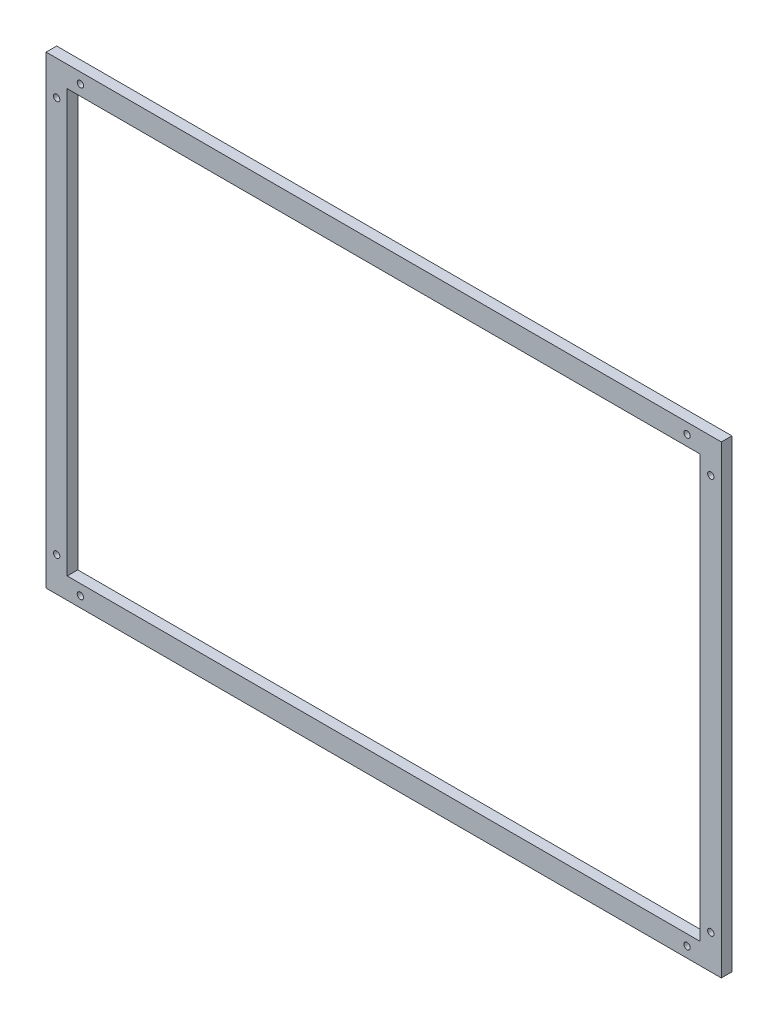
ISO-10303-21;
HEADER;
FILE_DESCRIPTION(('STEP AP214'),'2;1');
FILE_NAME('part.step','',(''),(''),'','','');
FILE_SCHEMA(('AUTOMOTIVE_DESIGN { 1 0 10303 214 1 1 1 1 }'));
ENDSEC;
DATA;
#1=APPLICATION_CONTEXT('core data for automotive mechanical design processes');
#2=APPLICATION_PROTOCOL_DEFINITION('international standard','automotive_design',2000,#1);
#3=PRODUCT_CONTEXT('',#1,'mechanical');
#4=PRODUCT('Part','Part','',(#3));
#5=PRODUCT_RELATED_PRODUCT_CATEGORY('part','',(#4));
#6=PRODUCT_DEFINITION_FORMATION('','',#4);
#7=PRODUCT_DEFINITION_CONTEXT('part definition',#1,'design');
#8=PRODUCT_DEFINITION('design','',#6,#7);
#9=PRODUCT_DEFINITION_SHAPE('','',#8);
#10=(LENGTH_UNIT() NAMED_UNIT(*) SI_UNIT(.MILLI.,.METRE.));
#11=(NAMED_UNIT(*) PLANE_ANGLE_UNIT() SI_UNIT($,.RADIAN.));
#12=(NAMED_UNIT(*) SI_UNIT($,.STERADIAN.) SOLID_ANGLE_UNIT());
#13=UNCERTAINTY_MEASURE_WITH_UNIT(LENGTH_MEASURE(1.E-05),#10,'distance_accuracy_value','');
#14=(GEOMETRIC_REPRESENTATION_CONTEXT(3) GLOBAL_UNCERTAINTY_ASSIGNED_CONTEXT((#13)) GLOBAL_UNIT_ASSIGNED_CONTEXT((#10,
#11,#12)) REPRESENTATION_CONTEXT('',''));
#15=CARTESIAN_POINT('',(0.,0.,0.));
#16=DIRECTION('',(0.,0.,1.));
#17=DIRECTION('',(1.,0.,0.));
#18=AXIS2_PLACEMENT_3D('',#15,#16,#17);
#19=CARTESIAN_POINT('',(0.,0.,10.));
#20=DIRECTION('',(0.,0.,1.));
#21=DIRECTION('',(1.,0.,0.));
#22=AXIS2_PLACEMENT_3D('',#19,#20,#21);
#23=PLANE('',#22);
#24=CARTESIAN_POINT('',(-10.,32.5,10.));
#25=DIRECTION('',(0.,0.,1.));
#26=DIRECTION('',(1.,0.,0.));
#27=AXIS2_PLACEMENT_3D('',#24,#25,#26);
#28=CIRCLE('',#27,3.);
#29=CARTESIAN_POINT('',(-7.,32.5,10.));
#30=VERTEX_POINT('',#29);
#31=EDGE_CURVE('E254',#30,#30,#28,.T.);
#32=ORIENTED_EDGE('',*,*,#31,.F.);
#33=EDGE_LOOP('',(#32));
#34=FACE_BOUND('',#33,.T.);
#35=CARTESIAN_POINT('',(-32.5,9.99999999999992,10.));
#36=DIRECTION('',(0.,0.,1.));
#37=DIRECTION('',(1.,0.,0.));
#38=AXIS2_PLACEMENT_3D('',#35,#36,#37);
#39=CIRCLE('',#38,3.);
#40=CARTESIAN_POINT('',(-29.5,9.99999999999992,10.));
#41=VERTEX_POINT('',#40);
#42=EDGE_CURVE('E256',#41,#41,#39,.T.);
#43=ORIENTED_EDGE('',*,*,#42,.F.);
#44=EDGE_LOOP('',(#43));
#45=FACE_BOUND('',#44,.T.);
#46=CARTESIAN_POINT('',(-607.5,9.99999999999995,10.));
#47=DIRECTION('',(0.,0.,1.));
#48=DIRECTION('',(1.,0.,0.));
#49=AXIS2_PLACEMENT_3D('',#46,#47,#48);
#50=CIRCLE('',#49,3.00000000000005);
#51=CARTESIAN_POINT('',(-604.5,9.99999999999995,10.));
#52=VERTEX_POINT('',#51);
#53=EDGE_CURVE('E262',#52,#52,#50,.T.);
#54=ORIENTED_EDGE('',*,*,#53,.F.);
#55=EDGE_LOOP('',(#54));
#56=FACE_BOUND('',#55,.T.);
#57=CARTESIAN_POINT('',(-630.,32.4999999999999,10.));
#58=DIRECTION('',(0.,0.,1.));
#59=DIRECTION('',(1.,0.,0.));
#60=AXIS2_PLACEMENT_3D('',#57,#58,#59);
#61=CIRCLE('',#60,3.00000000000005);
#62=CARTESIAN_POINT('',(-627.,32.4999999999999,10.));
#63=VERTEX_POINT('',#62);
#64=EDGE_CURVE('E268',#63,#63,#61,.T.);
#65=ORIENTED_EDGE('',*,*,#64,.F.);
#66=EDGE_LOOP('',(#65));
#67=FACE_BOUND('',#66,.T.);
#68=CARTESIAN_POINT('',(-630.,407.5,10.));
#69=DIRECTION('',(0.,0.,1.));
#70=DIRECTION('',(1.,0.,0.));
#71=AXIS2_PLACEMENT_3D('',#68,#69,#70);
#72=CIRCLE('',#71,3.00000000000005);
#73=CARTESIAN_POINT('',(-627.,407.5,10.));
#74=VERTEX_POINT('',#73);
#75=EDGE_CURVE('E274',#74,#74,#72,.T.);
#76=ORIENTED_EDGE('',*,*,#75,.F.);
#77=EDGE_LOOP('',(#76));
#78=FACE_BOUND('',#77,.T.);
#79=CARTESIAN_POINT('',(-607.5,430.,10.));
#80=DIRECTION('',(0.,0.,1.));
#81=DIRECTION('',(1.,0.,0.));
#82=AXIS2_PLACEMENT_3D('',#79,#80,#81);
#83=CIRCLE('',#82,3.00000000000005);
#84=CARTESIAN_POINT('',(-604.5,430.,10.));
#85=VERTEX_POINT('',#84);
#86=EDGE_CURVE('E280',#85,#85,#83,.T.);
#87=ORIENTED_EDGE('',*,*,#86,.F.);
#88=EDGE_LOOP('',(#87));
#89=FACE_BOUND('',#88,.T.);
#90=CARTESIAN_POINT('',(-10.,407.5,10.));
#91=DIRECTION('',(0.,0.,1.));
#92=DIRECTION('',(1.,0.,0.));
#93=AXIS2_PLACEMENT_3D('',#90,#91,#92);
#94=CIRCLE('',#93,3.);
#95=CARTESIAN_POINT('',(-7.,407.5,10.));
#96=VERTEX_POINT('',#95);
#97=EDGE_CURVE('E286',#96,#96,#94,.T.);
#98=ORIENTED_EDGE('',*,*,#97,.F.);
#99=EDGE_LOOP('',(#98));
#100=FACE_BOUND('',#99,.T.);
#101=CARTESIAN_POINT('',(-32.5,430.,10.));
#102=DIRECTION('',(0.,0.,1.));
#103=DIRECTION('',(1.,0.,0.));
#104=AXIS2_PLACEMENT_3D('',#101,#102,#103);
#105=CIRCLE('',#104,3.);
#106=CARTESIAN_POINT('',(-29.5,430.,10.));
#107=VERTEX_POINT('',#106);
#108=EDGE_CURVE('E292',#107,#107,#105,.T.);
#109=ORIENTED_EDGE('',*,*,#108,.F.);
#110=EDGE_LOOP('',(#109));
#111=FACE_BOUND('',#110,.T.);
#112=DIRECTION('',(0.,1.,0.));
#113=VECTOR('',#112,1.);
#114=CARTESIAN_POINT('',(0.,0.,10.));
#115=LINE('',#114,#113);
#116=CARTESIAN_POINT('',(0.,0.,10.));
#117=VERTEX_POINT('',#116);
#118=CARTESIAN_POINT('',(0.,440.,10.));
#119=VERTEX_POINT('',#118);
#120=EDGE_CURVE('E136',#117,#119,#115,.T.);
#121=ORIENTED_EDGE('',*,*,#120,.T.);
#122=DIRECTION('',(-1.,0.,0.));
#123=VECTOR('',#122,1.);
#124=CARTESIAN_POINT('',(0.,440.,10.));
#125=LINE('',#124,#123);
#126=CARTESIAN_POINT('',(-640.,440.,10.));
#127=VERTEX_POINT('',#126);
#128=EDGE_CURVE('E139',#119,#127,#125,.T.);
#129=ORIENTED_EDGE('',*,*,#128,.T.);
#130=DIRECTION('',(0.,-1.,0.));
#131=VECTOR('',#130,1.);
#132=CARTESIAN_POINT('',(-640.,0.,10.));
#133=LINE('',#132,#131);
#134=CARTESIAN_POINT('',(-640.,0.,10.));
#135=VERTEX_POINT('',#134);
#136=EDGE_CURVE('E142',#127,#135,#133,.T.);
#137=ORIENTED_EDGE('',*,*,#136,.T.);
#138=DIRECTION('',(1.,0.,0.));
#139=VECTOR('',#138,1.);
#140=CARTESIAN_POINT('',(0.,0.,10.));
#141=LINE('',#140,#139);
#142=EDGE_CURVE('E144',#135,#117,#141,.T.);
#143=ORIENTED_EDGE('',*,*,#142,.T.);
#144=EDGE_LOOP('',(#121,#129,#137,#143));
#145=FACE_BOUND('',#144,.T.);
#146=DIRECTION('',(1.,0.,0.));
#147=VECTOR('',#146,1.);
#148=CARTESIAN_POINT('',(-620.,19.9999999999999,10.));
#149=LINE('',#148,#147);
#150=CARTESIAN_POINT('',(-620.,19.9999999999999,10.));
#151=VERTEX_POINT('',#150);
#152=CARTESIAN_POINT('',(-20.,19.9999999999999,10.));
#153=VERTEX_POINT('',#152);
#154=EDGE_CURVE('E106',#151,#153,#149,.T.);
#155=ORIENTED_EDGE('',*,*,#154,.F.);
#156=DIRECTION('',(0.,-1.,0.));
#157=VECTOR('',#156,1.);
#158=CARTESIAN_POINT('',(-620.,420.,10.));
#159=LINE('',#158,#157);
#160=CARTESIAN_POINT('',(-620.,420.,10.));
#161=VERTEX_POINT('',#160);
#162=EDGE_CURVE('E98',#161,#151,#159,.T.);
#163=ORIENTED_EDGE('',*,*,#162,.F.);
#164=DIRECTION('',(-1.,0.,0.));
#165=VECTOR('',#164,1.);
#166=CARTESIAN_POINT('',(-620.,420.,10.));
#167=LINE('',#166,#165);
#168=CARTESIAN_POINT('',(-20.,420.,10.));
#169=VERTEX_POINT('',#168);
#170=EDGE_CURVE('E120',#169,#161,#167,.T.);
#171=ORIENTED_EDGE('',*,*,#170,.F.);
#172=DIRECTION('',(0.,1.,0.));
#173=VECTOR('',#172,1.);
#174=CARTESIAN_POINT('',(-20.,420.,10.));
#175=LINE('',#174,#173);
#176=EDGE_CURVE('E118',#153,#169,#175,.T.);
#177=ORIENTED_EDGE('',*,*,#176,.F.);
#178=EDGE_LOOP('',(#155,#163,#171,#177));
#179=FACE_BOUND('',#178,.T.);
#180=ADVANCED_FACE('F33',(#34,#45,#56,#67,#78,#89,#100,#111,#145,#179),#23,.T.);
#181=CARTESIAN_POINT('',(0.,0.,0.));
#182=DIRECTION('',(0.,0.,1.));
#183=DIRECTION('',(1.,0.,0.));
#184=AXIS2_PLACEMENT_3D('',#181,#182,#183);
#185=PLANE('',#184);
#186=CARTESIAN_POINT('',(-10.,32.5,0.));
#187=DIRECTION('',(0.,0.,1.));
#188=DIRECTION('',(1.,0.,0.));
#189=AXIS2_PLACEMENT_3D('',#186,#187,#188);
#190=CIRCLE('',#189,3.);
#191=CARTESIAN_POINT('',(-7.,32.5,0.));
#192=VERTEX_POINT('',#191);
#193=EDGE_CURVE('E252',#192,#192,#190,.T.);
#194=ORIENTED_EDGE('',*,*,#193,.T.);
#195=EDGE_LOOP('',(#194));
#196=FACE_BOUND('',#195,.T.);
#197=CARTESIAN_POINT('',(-32.5,9.99999999999992,0.));
#198=DIRECTION('',(0.,0.,1.));
#199=DIRECTION('',(1.,0.,0.));
#200=AXIS2_PLACEMENT_3D('',#197,#198,#199);
#201=CIRCLE('',#200,3.);
#202=CARTESIAN_POINT('',(-29.5,9.99999999999992,0.));
#203=VERTEX_POINT('',#202);
#204=EDGE_CURVE('E259',#203,#203,#201,.T.);
#205=ORIENTED_EDGE('',*,*,#204,.T.);
#206=EDGE_LOOP('',(#205));
#207=FACE_BOUND('',#206,.T.);
#208=CARTESIAN_POINT('',(-607.5,9.99999999999995,0.));
#209=DIRECTION('',(0.,0.,1.));
#210=DIRECTION('',(1.,0.,0.));
#211=AXIS2_PLACEMENT_3D('',#208,#209,#210);
#212=CIRCLE('',#211,3.00000000000005);
#213=CARTESIAN_POINT('',(-604.5,9.99999999999995,0.));
#214=VERTEX_POINT('',#213);
#215=EDGE_CURVE('E265',#214,#214,#212,.T.);
#216=ORIENTED_EDGE('',*,*,#215,.T.);
#217=EDGE_LOOP('',(#216));
#218=FACE_BOUND('',#217,.T.);
#219=CARTESIAN_POINT('',(-630.,32.4999999999999,0.));
#220=DIRECTION('',(0.,0.,1.));
#221=DIRECTION('',(1.,0.,0.));
#222=AXIS2_PLACEMENT_3D('',#219,#220,#221);
#223=CIRCLE('',#222,3.00000000000005);
#224=CARTESIAN_POINT('',(-627.,32.4999999999999,0.));
#225=VERTEX_POINT('',#224);
#226=EDGE_CURVE('E271',#225,#225,#223,.T.);
#227=ORIENTED_EDGE('',*,*,#226,.T.);
#228=EDGE_LOOP('',(#227));
#229=FACE_BOUND('',#228,.T.);
#230=CARTESIAN_POINT('',(-630.,407.5,0.));
#231=DIRECTION('',(0.,0.,1.));
#232=DIRECTION('',(1.,0.,0.));
#233=AXIS2_PLACEMENT_3D('',#230,#231,#232);
#234=CIRCLE('',#233,3.00000000000005);
#235=CARTESIAN_POINT('',(-627.,407.5,0.));
#236=VERTEX_POINT('',#235);
#237=EDGE_CURVE('E277',#236,#236,#234,.T.);
#238=ORIENTED_EDGE('',*,*,#237,.T.);
#239=EDGE_LOOP('',(#238));
#240=FACE_BOUND('',#239,.T.);
#241=CARTESIAN_POINT('',(-607.5,430.,0.));
#242=DIRECTION('',(0.,0.,1.));
#243=DIRECTION('',(1.,0.,0.));
#244=AXIS2_PLACEMENT_3D('',#241,#242,#243);
#245=CIRCLE('',#244,3.00000000000005);
#246=CARTESIAN_POINT('',(-604.5,430.,0.));
#247=VERTEX_POINT('',#246);
#248=EDGE_CURVE('E283',#247,#247,#245,.T.);
#249=ORIENTED_EDGE('',*,*,#248,.T.);
#250=EDGE_LOOP('',(#249));
#251=FACE_BOUND('',#250,.T.);
#252=CARTESIAN_POINT('',(-10.,407.5,0.));
#253=DIRECTION('',(0.,0.,1.));
#254=DIRECTION('',(1.,0.,0.));
#255=AXIS2_PLACEMENT_3D('',#252,#253,#254);
#256=CIRCLE('',#255,3.);
#257=CARTESIAN_POINT('',(-7.,407.5,0.));
#258=VERTEX_POINT('',#257);
#259=EDGE_CURVE('E289',#258,#258,#256,.T.);
#260=ORIENTED_EDGE('',*,*,#259,.T.);
#261=EDGE_LOOP('',(#260));
#262=FACE_BOUND('',#261,.T.);
#263=CARTESIAN_POINT('',(-32.5,430.,0.));
#264=DIRECTION('',(0.,0.,1.));
#265=DIRECTION('',(1.,0.,0.));
#266=AXIS2_PLACEMENT_3D('',#263,#264,#265);
#267=CIRCLE('',#266,3.);
#268=CARTESIAN_POINT('',(-29.5,430.,0.));
#269=VERTEX_POINT('',#268);
#270=EDGE_CURVE('E126',#269,#269,#267,.T.);
#271=ORIENTED_EDGE('',*,*,#270,.T.);
#272=EDGE_LOOP('',(#271));
#273=FACE_BOUND('',#272,.T.);
#274=DIRECTION('',(0.,1.,0.));
#275=VECTOR('',#274,1.);
#276=CARTESIAN_POINT('',(0.,0.,0.));
#277=LINE('',#276,#275);
#278=CARTESIAN_POINT('',(0.,0.,0.));
#279=VERTEX_POINT('',#278);
#280=CARTESIAN_POINT('',(0.,440.,0.));
#281=VERTEX_POINT('',#280);
#282=EDGE_CURVE('E114',#279,#281,#277,.T.);
#283=ORIENTED_EDGE('',*,*,#282,.F.);
#284=DIRECTION('',(1.,0.,0.));
#285=VECTOR('',#284,1.);
#286=CARTESIAN_POINT('',(0.,0.,0.));
#287=LINE('',#286,#285);
#288=CARTESIAN_POINT('',(-640.,0.,0.));
#289=VERTEX_POINT('',#288);
#290=EDGE_CURVE('E140',#289,#279,#287,.T.);
#291=ORIENTED_EDGE('',*,*,#290,.F.);
#292=DIRECTION('',(0.,-1.,0.));
#293=VECTOR('',#292,1.);
#294=CARTESIAN_POINT('',(-640.,0.,0.));
#295=LINE('',#294,#293);
#296=CARTESIAN_POINT('',(-640.,440.,0.));
#297=VERTEX_POINT('',#296);
#298=EDGE_CURVE('E151',#297,#289,#295,.T.);
#299=ORIENTED_EDGE('',*,*,#298,.F.);
#300=DIRECTION('',(-1.,0.,0.));
#301=VECTOR('',#300,1.);
#302=CARTESIAN_POINT('',(0.,440.,0.));
#303=LINE('',#302,#301);
#304=EDGE_CURVE('E149',#281,#297,#303,.T.);
#305=ORIENTED_EDGE('',*,*,#304,.F.);
#306=EDGE_LOOP('',(#283,#291,#299,#305));
#307=FACE_BOUND('',#306,.T.);
#308=DIRECTION('',(0.,-1.,0.));
#309=VECTOR('',#308,1.);
#310=CARTESIAN_POINT('',(-620.,420.,0.));
#311=LINE('',#310,#309);
#312=CARTESIAN_POINT('',(-620.,420.,0.));
#313=VERTEX_POINT('',#312);
#314=CARTESIAN_POINT('',(-620.,19.9999999999999,0.));
#315=VERTEX_POINT('',#314);
#316=EDGE_CURVE('E56',#313,#315,#311,.T.);
#317=ORIENTED_EDGE('',*,*,#316,.T.);
#318=DIRECTION('',(1.,0.,0.));
#319=VECTOR('',#318,1.);
#320=CARTESIAN_POINT('',(-620.,19.9999999999999,0.));
#321=LINE('',#320,#319);
#322=CARTESIAN_POINT('',(-20.,19.9999999999999,0.));
#323=VERTEX_POINT('',#322);
#324=EDGE_CURVE('E113',#315,#323,#321,.T.);
#325=ORIENTED_EDGE('',*,*,#324,.T.);
#326=DIRECTION('',(0.,1.,0.));
#327=VECTOR('',#326,1.);
#328=CARTESIAN_POINT('',(-20.,420.,0.));
#329=LINE('',#328,#327);
#330=CARTESIAN_POINT('',(-20.,420.,0.));
#331=VERTEX_POINT('',#330);
#332=EDGE_CURVE('E128',#323,#331,#329,.T.);
#333=ORIENTED_EDGE('',*,*,#332,.T.);
#334=DIRECTION('',(-1.,0.,0.));
#335=VECTOR('',#334,1.);
#336=CARTESIAN_POINT('',(-620.,420.,0.));
#337=LINE('',#336,#335);
#338=EDGE_CURVE('E107',#331,#313,#337,.T.);
#339=ORIENTED_EDGE('',*,*,#338,.T.);
#340=EDGE_LOOP('',(#317,#325,#333,#339));
#341=FACE_BOUND('',#340,.T.);
#342=ADVANCED_FACE('F169',(#196,#207,#218,#229,#240,#251,#262,#273,#307,#341),#185,.F.);
#343=CARTESIAN_POINT('',(0.,0.,10.));
#344=DIRECTION('',(-1.,0.,0.));
#345=DIRECTION('',(0.,0.,1.));
#346=AXIS2_PLACEMENT_3D('',#343,#344,#345);
#347=PLANE('',#346);
#348=ORIENTED_EDGE('',*,*,#282,.T.);
#349=DIRECTION('',(0.,0.,-1.));
#350=VECTOR('',#349,1.);
#351=CARTESIAN_POINT('',(0.,440.,10.));
#352=LINE('',#351,#350);
#353=EDGE_CURVE('E11',#119,#281,#352,.T.);
#354=ORIENTED_EDGE('',*,*,#353,.F.);
#355=ORIENTED_EDGE('',*,*,#120,.F.);
#356=DIRECTION('',(0.,0.,-1.));
#357=VECTOR('',#356,1.);
#358=CARTESIAN_POINT('',(0.,0.,10.));
#359=LINE('',#358,#357);
#360=EDGE_CURVE('E146',#117,#279,#359,.T.);
#361=ORIENTED_EDGE('',*,*,#360,.T.);
#362=EDGE_LOOP('',(#348,#354,#355,#361));
#363=FACE_BOUND('',#362,.T.);
#364=ADVANCED_FACE('F35',(#363),#347,.F.);
#365=CARTESIAN_POINT('',(0.,440.,10.));
#366=DIRECTION('',(0.,-1.,0.));
#367=DIRECTION('',(1.,0.,0.));
#368=AXIS2_PLACEMENT_3D('',#365,#366,#367);
#369=PLANE('',#368);
#370=ORIENTED_EDGE('',*,*,#304,.T.);
#371=DIRECTION('',(0.,0.,-1.));
#372=VECTOR('',#371,1.);
#373=CARTESIAN_POINT('',(-640.,440.,10.));
#374=LINE('',#373,#372);
#375=EDGE_CURVE('E41',#127,#297,#374,.T.);
#376=ORIENTED_EDGE('',*,*,#375,.F.);
#377=ORIENTED_EDGE('',*,*,#128,.F.);
#378=ORIENTED_EDGE('',*,*,#353,.T.);
#379=EDGE_LOOP('',(#370,#376,#377,#378));
#380=FACE_BOUND('',#379,.T.);
#381=ADVANCED_FACE('F179',(#380),#369,.F.);
#382=CARTESIAN_POINT('',(-640.,0.,10.));
#383=DIRECTION('',(1.,0.,0.));
#384=DIRECTION('',(0.,0.,-1.));
#385=AXIS2_PLACEMENT_3D('',#382,#383,#384);
#386=PLANE('',#385);
#387=ORIENTED_EDGE('',*,*,#298,.T.);
#388=DIRECTION('',(0.,0.,-1.));
#389=VECTOR('',#388,1.);
#390=CARTESIAN_POINT('',(-640.,0.,10.));
#391=LINE('',#390,#389);
#392=EDGE_CURVE('E156',#135,#289,#391,.T.);
#393=ORIENTED_EDGE('',*,*,#392,.F.);
#394=ORIENTED_EDGE('',*,*,#136,.F.);
#395=ORIENTED_EDGE('',*,*,#375,.T.);
#396=EDGE_LOOP('',(#387,#393,#394,#395));
#397=FACE_BOUND('',#396,.T.);
#398=ADVANCED_FACE('F163',(#397),#386,.F.);
#399=CARTESIAN_POINT('',(0.,0.,10.));
#400=DIRECTION('',(0.,1.,0.));
#401=DIRECTION('',(-1.,0.,0.));
#402=AXIS2_PLACEMENT_3D('',#399,#400,#401);
#403=PLANE('',#402);
#404=ORIENTED_EDGE('',*,*,#290,.T.);
#405=ORIENTED_EDGE('',*,*,#360,.F.);
#406=ORIENTED_EDGE('',*,*,#142,.F.);
#407=ORIENTED_EDGE('',*,*,#392,.T.);
#408=EDGE_LOOP('',(#404,#405,#406,#407));
#409=FACE_BOUND('',#408,.T.);
#410=ADVANCED_FACE('F173',(#409),#403,.F.);
#411=CARTESIAN_POINT('',(-620.,420.,10.));
#412=DIRECTION('',(1.,0.,0.));
#413=DIRECTION('',(0.,1.,0.));
#414=AXIS2_PLACEMENT_3D('',#411,#412,#413);
#415=PLANE('',#414);
#416=ORIENTED_EDGE('',*,*,#316,.F.);
#417=DIRECTION('',(0.,0.,-1.));
#418=VECTOR('',#417,1.);
#419=CARTESIAN_POINT('',(-620.,420.,10.));
#420=LINE('',#419,#418);
#421=EDGE_CURVE('E102',#161,#313,#420,.T.);
#422=ORIENTED_EDGE('',*,*,#421,.F.);
#423=ORIENTED_EDGE('',*,*,#162,.T.);
#424=DIRECTION('',(0.,0.,-1.));
#425=VECTOR('',#424,1.);
#426=CARTESIAN_POINT('',(-620.,19.9999999999999,10.));
#427=LINE('',#426,#425);
#428=EDGE_CURVE('E101',#151,#315,#427,.T.);
#429=ORIENTED_EDGE('',*,*,#428,.T.);
#430=EDGE_LOOP('',(#416,#422,#423,#429));
#431=FACE_BOUND('',#430,.T.);
#432=ADVANCED_FACE('F100',(#431),#415,.T.);
#433=CARTESIAN_POINT('',(-620.,19.9999999999999,10.));
#434=DIRECTION('',(0.,1.,0.));
#435=DIRECTION('',(-1.,0.,0.));
#436=AXIS2_PLACEMENT_3D('',#433,#434,#435);
#437=PLANE('',#436);
#438=ORIENTED_EDGE('',*,*,#324,.F.);
#439=ORIENTED_EDGE('',*,*,#428,.F.);
#440=ORIENTED_EDGE('',*,*,#154,.T.);
#441=DIRECTION('',(0.,0.,-1.));
#442=VECTOR('',#441,1.);
#443=CARTESIAN_POINT('',(-20.,19.9999999999999,10.));
#444=LINE('',#443,#442);
#445=EDGE_CURVE('E115',#153,#323,#444,.T.);
#446=ORIENTED_EDGE('',*,*,#445,.T.);
#447=EDGE_LOOP('',(#438,#439,#440,#446));
#448=FACE_BOUND('',#447,.T.);
#449=ADVANCED_FACE('F110',(#448),#437,.T.);
#450=CARTESIAN_POINT('',(-20.,420.,10.));
#451=DIRECTION('',(-1.,0.,0.));
#452=DIRECTION('',(0.,0.,1.));
#453=AXIS2_PLACEMENT_3D('',#450,#451,#452);
#454=PLANE('',#453);
#455=ORIENTED_EDGE('',*,*,#332,.F.);
#456=ORIENTED_EDGE('',*,*,#445,.F.);
#457=ORIENTED_EDGE('',*,*,#176,.T.);
#458=DIRECTION('',(0.,0.,-1.));
#459=VECTOR('',#458,1.);
#460=CARTESIAN_POINT('',(-20.,420.,10.));
#461=LINE('',#460,#459);
#462=EDGE_CURVE('E48',#169,#331,#461,.T.);
#463=ORIENTED_EDGE('',*,*,#462,.T.);
#464=EDGE_LOOP('',(#455,#456,#457,#463));
#465=FACE_BOUND('',#464,.T.);
#466=ADVANCED_FACE('F206',(#465),#454,.T.);
#467=CARTESIAN_POINT('',(-620.,420.,10.));
#468=DIRECTION('',(0.,-1.,0.));
#469=DIRECTION('',(0.,0.,-1.));
#470=AXIS2_PLACEMENT_3D('',#467,#468,#469);
#471=PLANE('',#470);
#472=ORIENTED_EDGE('',*,*,#338,.F.);
#473=ORIENTED_EDGE('',*,*,#462,.F.);
#474=ORIENTED_EDGE('',*,*,#170,.T.);
#475=ORIENTED_EDGE('',*,*,#421,.T.);
#476=EDGE_LOOP('',(#472,#473,#474,#475));
#477=FACE_BOUND('',#476,.T.);
#478=ADVANCED_FACE('F210',(#477),#471,.T.);
#479=CARTESIAN_POINT('',(-32.5,430.,0.));
#480=DIRECTION('',(0.,0.,1.));
#481=DIRECTION('',(1.,0.,0.));
#482=AXIS2_PLACEMENT_3D('',#479,#480,#481);
#483=CYLINDRICAL_SURFACE('',#482,3.);
#484=ORIENTED_EDGE('',*,*,#270,.F.);
#485=EDGE_LOOP('',(#484));
#486=FACE_BOUND('',#485,.T.);
#487=ORIENTED_EDGE('',*,*,#108,.T.);
#488=EDGE_LOOP('',(#487));
#489=FACE_BOUND('',#488,.T.);
#490=ADVANCED_FACE('F216',(#486,#489),#483,.F.);
#491=CARTESIAN_POINT('',(-10.,407.5,0.));
#492=DIRECTION('',(0.,0.,1.));
#493=DIRECTION('',(1.,0.,0.));
#494=AXIS2_PLACEMENT_3D('',#491,#492,#493);
#495=CYLINDRICAL_SURFACE('',#494,3.);
#496=ORIENTED_EDGE('',*,*,#259,.F.);
#497=EDGE_LOOP('',(#496));
#498=FACE_BOUND('',#497,.T.);
#499=ORIENTED_EDGE('',*,*,#97,.T.);
#500=EDGE_LOOP('',(#499));
#501=FACE_BOUND('',#500,.T.);
#502=ADVANCED_FACE('F219',(#498,#501),#495,.F.);
#503=CARTESIAN_POINT('',(-607.5,430.,0.));
#504=DIRECTION('',(0.,0.,1.));
#505=DIRECTION('',(1.,0.,0.));
#506=AXIS2_PLACEMENT_3D('',#503,#504,#505);
#507=CYLINDRICAL_SURFACE('',#506,3.00000000000005);
#508=ORIENTED_EDGE('',*,*,#248,.F.);
#509=EDGE_LOOP('',(#508));
#510=FACE_BOUND('',#509,.T.);
#511=ORIENTED_EDGE('',*,*,#86,.T.);
#512=EDGE_LOOP('',(#511));
#513=FACE_BOUND('',#512,.T.);
#514=ADVANCED_FACE('F223',(#510,#513),#507,.F.);
#515=CARTESIAN_POINT('',(-630.,407.5,0.));
#516=DIRECTION('',(0.,0.,1.));
#517=DIRECTION('',(1.,0.,0.));
#518=AXIS2_PLACEMENT_3D('',#515,#516,#517);
#519=CYLINDRICAL_SURFACE('',#518,3.00000000000005);
#520=ORIENTED_EDGE('',*,*,#237,.F.);
#521=EDGE_LOOP('',(#520));
#522=FACE_BOUND('',#521,.T.);
#523=ORIENTED_EDGE('',*,*,#75,.T.);
#524=EDGE_LOOP('',(#523));
#525=FACE_BOUND('',#524,.T.);
#526=ADVANCED_FACE('F227',(#522,#525),#519,.F.);
#527=CARTESIAN_POINT('',(-630.,32.4999999999999,0.));
#528=DIRECTION('',(0.,0.,1.));
#529=DIRECTION('',(1.,0.,0.));
#530=AXIS2_PLACEMENT_3D('',#527,#528,#529);
#531=CYLINDRICAL_SURFACE('',#530,3.00000000000005);
#532=ORIENTED_EDGE('',*,*,#226,.F.);
#533=EDGE_LOOP('',(#532));
#534=FACE_BOUND('',#533,.T.);
#535=ORIENTED_EDGE('',*,*,#64,.T.);
#536=EDGE_LOOP('',(#535));
#537=FACE_BOUND('',#536,.T.);
#538=ADVANCED_FACE('F231',(#534,#537),#531,.F.);
#539=CARTESIAN_POINT('',(-607.5,9.99999999999995,0.));
#540=DIRECTION('',(0.,0.,1.));
#541=DIRECTION('',(1.,0.,0.));
#542=AXIS2_PLACEMENT_3D('',#539,#540,#541);
#543=CYLINDRICAL_SURFACE('',#542,3.00000000000005);
#544=ORIENTED_EDGE('',*,*,#215,.F.);
#545=EDGE_LOOP('',(#544));
#546=FACE_BOUND('',#545,.T.);
#547=ORIENTED_EDGE('',*,*,#53,.T.);
#548=EDGE_LOOP('',(#547));
#549=FACE_BOUND('',#548,.T.);
#550=ADVANCED_FACE('F235',(#546,#549),#543,.F.);
#551=CARTESIAN_POINT('',(-32.5,9.99999999999992,0.));
#552=DIRECTION('',(0.,0.,1.));
#553=DIRECTION('',(1.,0.,0.));
#554=AXIS2_PLACEMENT_3D('',#551,#552,#553);
#555=CYLINDRICAL_SURFACE('',#554,3.);
#556=ORIENTED_EDGE('',*,*,#204,.F.);
#557=EDGE_LOOP('',(#556));
#558=FACE_BOUND('',#557,.T.);
#559=ORIENTED_EDGE('',*,*,#42,.T.);
#560=EDGE_LOOP('',(#559));
#561=FACE_BOUND('',#560,.T.);
#562=ADVANCED_FACE('F239',(#558,#561),#555,.F.);
#563=CARTESIAN_POINT('',(-10.,32.5,0.));
#564=DIRECTION('',(0.,0.,1.));
#565=DIRECTION('',(1.,0.,0.));
#566=AXIS2_PLACEMENT_3D('',#563,#564,#565);
#567=CYLINDRICAL_SURFACE('',#566,3.);
#568=ORIENTED_EDGE('',*,*,#193,.F.);
#569=EDGE_LOOP('',(#568));
#570=FACE_BOUND('',#569,.T.);
#571=ORIENTED_EDGE('',*,*,#31,.T.);
#572=EDGE_LOOP('',(#571));
#573=FACE_BOUND('',#572,.T.);
#574=ADVANCED_FACE('F243',(#570,#573),#567,.F.);
#575=CLOSED_SHELL('',(#180,#342,#364,#381,#398,#410,#432,#449,#466,#478,#490,#502,#514,#526,
#538,#550,#562,#574));
#576=MANIFOLD_SOLID_BREP('B2',#575);
#577=ADVANCED_BREP_SHAPE_REPRESENTATION('',(#18,#576),#14);
#578=SHAPE_DEFINITION_REPRESENTATION(#9,#577);
ENDSEC;
END-ISO-10303-21;
